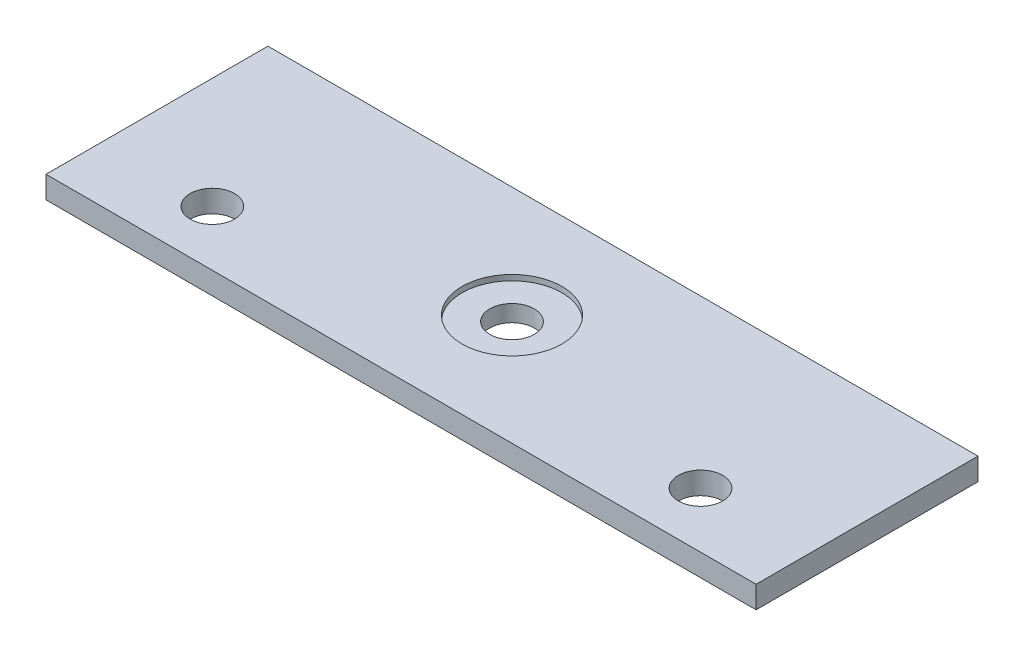
ISO-10303-21;
HEADER;
FILE_DESCRIPTION(('STEP AP214'),'2;1');
FILE_NAME('part.step','',(''),(''),'','','');
FILE_SCHEMA(('AUTOMOTIVE_DESIGN { 1 0 10303 214 1 1 1 1 }'));
ENDSEC;
DATA;
#1=APPLICATION_CONTEXT('core data for automotive mechanical design processes');
#2=APPLICATION_PROTOCOL_DEFINITION('international standard','automotive_design',2000,#1);
#3=PRODUCT_CONTEXT('',#1,'mechanical');
#4=PRODUCT('Part','Part','',(#3));
#5=PRODUCT_RELATED_PRODUCT_CATEGORY('part','',(#4));
#6=PRODUCT_DEFINITION_FORMATION('','',#4);
#7=PRODUCT_DEFINITION_CONTEXT('part definition',#1,'design');
#8=PRODUCT_DEFINITION('design','',#6,#7);
#9=PRODUCT_DEFINITION_SHAPE('','',#8);
#10=(LENGTH_UNIT() NAMED_UNIT(*) SI_UNIT(.MILLI.,.METRE.));
#11=(NAMED_UNIT(*) PLANE_ANGLE_UNIT() SI_UNIT($,.RADIAN.));
#12=(NAMED_UNIT(*) SI_UNIT($,.STERADIAN.) SOLID_ANGLE_UNIT());
#13=UNCERTAINTY_MEASURE_WITH_UNIT(LENGTH_MEASURE(1.E-05),#10,'distance_accuracy_value','');
#14=(GEOMETRIC_REPRESENTATION_CONTEXT(3) GLOBAL_UNCERTAINTY_ASSIGNED_CONTEXT((#13)) GLOBAL_UNIT_ASSIGNED_CONTEXT((#10,
#11,#12)) REPRESENTATION_CONTEXT('',''));
#15=CARTESIAN_POINT('',(0.,0.,0.));
#16=DIRECTION('',(0.,0.,1.));
#17=DIRECTION('',(1.,0.,0.));
#18=AXIS2_PLACEMENT_3D('',#15,#16,#17);
#19=CARTESIAN_POINT('',(0.,6.35,0.));
#20=DIRECTION('',(-1.,0.,0.));
#21=DIRECTION('',(0.,0.,1.));
#22=AXIS2_PLACEMENT_3D('',#19,#20,#21);
#23=PLANE('',#22);
#24=DIRECTION('',(0.,0.,-1.));
#25=VECTOR('',#24,1.);
#26=CARTESIAN_POINT('',(0.,0.,0.));
#27=LINE('',#26,#25);
#28=CARTESIAN_POINT('',(0.,0.,0.));
#29=VERTEX_POINT('',#28);
#30=CARTESIAN_POINT('',(0.,0.,-63.5));
#31=VERTEX_POINT('',#30);
#32=EDGE_CURVE('E95',#29,#31,#27,.T.);
#33=ORIENTED_EDGE('',*,*,#32,.T.);
#34=DIRECTION('',(0.,-1.,0.));
#35=VECTOR('',#34,1.);
#36=CARTESIAN_POINT('',(0.,6.35,-63.5));
#37=LINE('',#36,#35);
#38=CARTESIAN_POINT('',(0.,6.35,-63.5));
#39=VERTEX_POINT('',#38);
#40=EDGE_CURVE('E11',#39,#31,#37,.T.);
#41=ORIENTED_EDGE('',*,*,#40,.F.);
#42=DIRECTION('',(0.,0.,-1.));
#43=VECTOR('',#42,1.);
#44=CARTESIAN_POINT('',(0.,6.35,0.));
#45=LINE('',#44,#43);
#46=CARTESIAN_POINT('',(0.,6.35,0.));
#47=VERTEX_POINT('',#46);
#48=EDGE_CURVE('E83',#47,#39,#45,.T.);
#49=ORIENTED_EDGE('',*,*,#48,.F.);
#50=DIRECTION('',(0.,-1.,0.));
#51=VECTOR('',#50,1.);
#52=CARTESIAN_POINT('',(0.,6.35,0.));
#53=LINE('',#52,#51);
#54=EDGE_CURVE('E91',#47,#29,#53,.T.);
#55=ORIENTED_EDGE('',*,*,#54,.T.);
#56=EDGE_LOOP('',(#33,#41,#49,#55));
#57=FACE_BOUND('',#56,.T.);
#58=ADVANCED_FACE('F32',(#57),#23,.F.);
#59=CARTESIAN_POINT('',(0.,6.35,-63.5));
#60=DIRECTION('',(0.,0.,1.));
#61=DIRECTION('',(1.,0.,0.));
#62=AXIS2_PLACEMENT_3D('',#59,#60,#61);
#63=PLANE('',#62);
#64=DIRECTION('',(-1.,0.,0.));
#65=VECTOR('',#64,1.);
#66=CARTESIAN_POINT('',(0.,0.,-63.5));
#67=LINE('',#66,#65);
#68=CARTESIAN_POINT('',(-203.2,0.,-63.5));
#69=VERTEX_POINT('',#68);
#70=EDGE_CURVE('E87',#31,#69,#67,.T.);
#71=ORIENTED_EDGE('',*,*,#70,.T.);
#72=DIRECTION('',(0.,-1.,0.));
#73=VECTOR('',#72,1.);
#74=CARTESIAN_POINT('',(-203.2,6.35,-63.5));
#75=LINE('',#74,#73);
#76=CARTESIAN_POINT('',(-203.2,6.35,-63.5));
#77=VERTEX_POINT('',#76);
#78=EDGE_CURVE('E40',#77,#69,#75,.T.);
#79=ORIENTED_EDGE('',*,*,#78,.F.);
#80=DIRECTION('',(-1.,0.,0.));
#81=VECTOR('',#80,1.);
#82=CARTESIAN_POINT('',(0.,6.35,-63.5));
#83=LINE('',#82,#81);
#84=EDGE_CURVE('E78',#39,#77,#83,.T.);
#85=ORIENTED_EDGE('',*,*,#84,.F.);
#86=ORIENTED_EDGE('',*,*,#40,.T.);
#87=EDGE_LOOP('',(#71,#79,#85,#86));
#88=FACE_BOUND('',#87,.T.);
#89=ADVANCED_FACE('F86',(#88),#63,.F.);
#90=CARTESIAN_POINT('',(-203.2,6.35,0.));
#91=DIRECTION('',(1.,0.,0.));
#92=DIRECTION('',(0.,0.,-1.));
#93=AXIS2_PLACEMENT_3D('',#90,#91,#92);
#94=PLANE('',#93);
#95=DIRECTION('',(0.,0.,1.));
#96=VECTOR('',#95,1.);
#97=CARTESIAN_POINT('',(-203.2,0.,0.));
#98=LINE('',#97,#96);
#99=CARTESIAN_POINT('',(-203.2,0.,0.));
#100=VERTEX_POINT('',#99);
#101=EDGE_CURVE('E65',#69,#100,#98,.T.);
#102=ORIENTED_EDGE('',*,*,#101,.T.);
#103=DIRECTION('',(0.,-1.,0.));
#104=VECTOR('',#103,1.);
#105=CARTESIAN_POINT('',(-203.2,6.35,0.));
#106=LINE('',#105,#104);
#107=CARTESIAN_POINT('',(-203.2,6.35,0.));
#108=VERTEX_POINT('',#107);
#109=EDGE_CURVE('E88',#108,#100,#106,.T.);
#110=ORIENTED_EDGE('',*,*,#109,.F.);
#111=DIRECTION('',(0.,0.,1.));
#112=VECTOR('',#111,1.);
#113=CARTESIAN_POINT('',(-203.2,6.35,0.));
#114=LINE('',#113,#112);
#115=EDGE_CURVE('E81',#77,#108,#114,.T.);
#116=ORIENTED_EDGE('',*,*,#115,.F.);
#117=ORIENTED_EDGE('',*,*,#78,.T.);
#118=EDGE_LOOP('',(#102,#110,#116,#117));
#119=FACE_BOUND('',#118,.T.);
#120=ADVANCED_FACE('F89',(#119),#94,.F.);
#121=CARTESIAN_POINT('',(0.,6.35,0.));
#122=DIRECTION('',(0.,0.,-1.));
#123=DIRECTION('',(-1.,0.,0.));
#124=AXIS2_PLACEMENT_3D('',#121,#122,#123);
#125=PLANE('',#124);
#126=DIRECTION('',(1.,0.,0.));
#127=VECTOR('',#126,1.);
#128=CARTESIAN_POINT('',(0.,0.,0.));
#129=LINE('',#128,#127);
#130=EDGE_CURVE('E71',#100,#29,#129,.T.);
#131=ORIENTED_EDGE('',*,*,#130,.T.);
#132=ORIENTED_EDGE('',*,*,#54,.F.);
#133=DIRECTION('',(1.,0.,0.));
#134=VECTOR('',#133,1.);
#135=CARTESIAN_POINT('',(0.,6.35,0.));
#136=LINE('',#135,#134);
#137=EDGE_CURVE('E48',#108,#47,#136,.T.);
#138=ORIENTED_EDGE('',*,*,#137,.F.);
#139=ORIENTED_EDGE('',*,*,#109,.T.);
#140=EDGE_LOOP('',(#131,#132,#138,#139));
#141=FACE_BOUND('',#140,.T.);
#142=ADVANCED_FACE('F103',(#141),#125,.F.);
#143=CARTESIAN_POINT('',(0.,6.35,0.));
#144=DIRECTION('',(0.,1.,0.));
#145=DIRECTION('',(0.,0.,1.));
#146=AXIS2_PLACEMENT_3D('',#143,#144,#145);
#147=PLANE('',#146);
#148=CARTESIAN_POINT('',(-171.45,6.35,-15.85));
#149=DIRECTION('',(0.,1.,0.));
#150=DIRECTION('',(0.,0.,1.));
#151=AXIS2_PLACEMENT_3D('',#148,#149,#150);
#152=CIRCLE('',#151,6.35);
#153=CARTESIAN_POINT('',(-171.45,6.35,-9.50000000000001));
#154=VERTEX_POINT('',#153);
#155=EDGE_CURVE('E127',#154,#154,#152,.T.);
#156=ORIENTED_EDGE('',*,*,#155,.F.);
#157=EDGE_LOOP('',(#156));
#158=FACE_BOUND('',#157,.T.);
#159=CARTESIAN_POINT('',(-31.75,6.35,-15.85));
#160=DIRECTION('',(0.,1.,0.));
#161=DIRECTION('',(0.,0.,1.));
#162=AXIS2_PLACEMENT_3D('',#159,#160,#161);
#163=CIRCLE('',#162,6.35);
#164=CARTESIAN_POINT('',(-31.75,6.35,-9.5));
#165=VERTEX_POINT('',#164);
#166=EDGE_CURVE('E121',#165,#165,#163,.T.);
#167=ORIENTED_EDGE('',*,*,#166,.F.);
#168=EDGE_LOOP('',(#167));
#169=FACE_BOUND('',#168,.T.);
#170=CARTESIAN_POINT('',(-101.6,6.35,-31.75));
#171=DIRECTION('',(0.,1.,0.));
#172=DIRECTION('',(0.,0.,1.));
#173=AXIS2_PLACEMENT_3D('',#170,#171,#172);
#174=CIRCLE('',#173,14.2875);
#175=CARTESIAN_POINT('',(-101.6,6.35,-17.4625));
#176=VERTEX_POINT('',#175);
#177=EDGE_CURVE('E109',#176,#176,#174,.T.);
#178=ORIENTED_EDGE('',*,*,#177,.F.);
#179=EDGE_LOOP('',(#178));
#180=FACE_BOUND('',#179,.T.);
#181=ORIENTED_EDGE('',*,*,#48,.T.);
#182=ORIENTED_EDGE('',*,*,#84,.T.);
#183=ORIENTED_EDGE('',*,*,#115,.T.);
#184=ORIENTED_EDGE('',*,*,#137,.T.);
#185=EDGE_LOOP('',(#181,#182,#183,#184));
#186=FACE_BOUND('',#185,.T.);
#187=ADVANCED_FACE('F79',(#158,#169,#180,#186),#147,.T.);
#188=CARTESIAN_POINT('',(0.,0.,0.));
#189=DIRECTION('',(0.,1.,0.));
#190=DIRECTION('',(0.,0.,1.));
#191=AXIS2_PLACEMENT_3D('',#188,#189,#190);
#192=PLANE('',#191);
#193=CARTESIAN_POINT('',(-171.45,0.,-15.85));
#194=DIRECTION('',(0.,1.,0.));
#195=DIRECTION('',(0.,0.,1.));
#196=AXIS2_PLACEMENT_3D('',#193,#194,#195);
#197=CIRCLE('',#196,6.35);
#198=CARTESIAN_POINT('',(-171.45,0.,-9.50000000000001));
#199=VERTEX_POINT('',#198);
#200=EDGE_CURVE('E118',#199,#199,#197,.T.);
#201=ORIENTED_EDGE('',*,*,#200,.T.);
#202=EDGE_LOOP('',(#201));
#203=FACE_BOUND('',#202,.T.);
#204=CARTESIAN_POINT('',(-31.75,0.,-15.85));
#205=DIRECTION('',(0.,1.,0.));
#206=DIRECTION('',(0.,0.,1.));
#207=AXIS2_PLACEMENT_3D('',#204,#205,#206);
#208=CIRCLE('',#207,6.35);
#209=CARTESIAN_POINT('',(-31.75,0.,-9.5));
#210=VERTEX_POINT('',#209);
#211=EDGE_CURVE('E124',#210,#210,#208,.T.);
#212=ORIENTED_EDGE('',*,*,#211,.T.);
#213=EDGE_LOOP('',(#212));
#214=FACE_BOUND('',#213,.T.);
#215=CARTESIAN_POINT('',(-101.6,0.,-31.75));
#216=DIRECTION('',(0.,1.,0.));
#217=DIRECTION('',(0.,0.,1.));
#218=AXIS2_PLACEMENT_3D('',#215,#216,#217);
#219=CIRCLE('',#218,6.35000000000001);
#220=CARTESIAN_POINT('',(-101.6,0.,-25.4));
#221=VERTEX_POINT('',#220);
#222=EDGE_CURVE('E112',#221,#221,#219,.T.);
#223=ORIENTED_EDGE('',*,*,#222,.T.);
#224=EDGE_LOOP('',(#223));
#225=FACE_BOUND('',#224,.T.);
#226=ORIENTED_EDGE('',*,*,#32,.F.);
#227=ORIENTED_EDGE('',*,*,#130,.F.);
#228=ORIENTED_EDGE('',*,*,#101,.F.);
#229=ORIENTED_EDGE('',*,*,#70,.F.);
#230=EDGE_LOOP('',(#226,#227,#228,#229));
#231=FACE_BOUND('',#230,.T.);
#232=ADVANCED_FACE('F106',(#203,#214,#225,#231),#192,.F.);
#233=CARTESIAN_POINT('',(-101.6,4.7625,-31.75));
#234=DIRECTION('',(0.,1.,0.));
#235=DIRECTION('',(0.,0.,1.));
#236=AXIS2_PLACEMENT_3D('',#233,#234,#235);
#237=CYLINDRICAL_SURFACE('',#236,14.2875);
#238=CARTESIAN_POINT('',(-101.6,4.7625,-31.75));
#239=DIRECTION('',(0.,1.,0.));
#240=DIRECTION('',(0.,0.,1.));
#241=AXIS2_PLACEMENT_3D('',#238,#239,#240);
#242=CIRCLE('',#241,14.2875);
#243=CARTESIAN_POINT('',(-101.6,4.7625,-17.4625));
#244=VERTEX_POINT('',#243);
#245=EDGE_CURVE('E98',#244,#244,#242,.T.);
#246=ORIENTED_EDGE('',*,*,#245,.F.);
#247=EDGE_LOOP('',(#246));
#248=FACE_BOUND('',#247,.T.);
#249=ORIENTED_EDGE('',*,*,#177,.T.);
#250=EDGE_LOOP('',(#249));
#251=FACE_BOUND('',#250,.T.);
#252=ADVANCED_FACE('F149',(#248,#251),#237,.F.);
#253=CARTESIAN_POINT('',(-101.6,4.7625,-31.75));
#254=DIRECTION('',(0.,1.,0.));
#255=DIRECTION('',(0.,0.,1.));
#256=AXIS2_PLACEMENT_3D('',#253,#254,#255);
#257=PLANE('',#256);
#258=CARTESIAN_POINT('',(-101.6,4.7625,-31.75));
#259=DIRECTION('',(0.,1.,0.));
#260=DIRECTION('',(0.,0.,1.));
#261=AXIS2_PLACEMENT_3D('',#258,#259,#260);
#262=CIRCLE('',#261,6.35000000000001);
#263=CARTESIAN_POINT('',(-101.6,4.7625,-25.4));
#264=VERTEX_POINT('',#263);
#265=EDGE_CURVE('E115',#264,#264,#262,.T.);
#266=ORIENTED_EDGE('',*,*,#265,.F.);
#267=EDGE_LOOP('',(#266));
#268=FACE_BOUND('',#267,.T.);
#269=ORIENTED_EDGE('',*,*,#245,.T.);
#270=EDGE_LOOP('',(#269));
#271=FACE_BOUND('',#270,.T.);
#272=ADVANCED_FACE('F151',(#268,#271),#257,.T.);
#273=CARTESIAN_POINT('',(-101.6,0.,-31.75));
#274=DIRECTION('',(0.,1.,0.));
#275=DIRECTION('',(0.,0.,1.));
#276=AXIS2_PLACEMENT_3D('',#273,#274,#275);
#277=CYLINDRICAL_SURFACE('',#276,6.35000000000001);
#278=ORIENTED_EDGE('',*,*,#222,.F.);
#279=EDGE_LOOP('',(#278));
#280=FACE_BOUND('',#279,.T.);
#281=ORIENTED_EDGE('',*,*,#265,.T.);
#282=EDGE_LOOP('',(#281));
#283=FACE_BOUND('',#282,.T.);
#284=ADVANCED_FACE('F158',(#280,#283),#277,.F.);
#285=CARTESIAN_POINT('',(-31.75,0.,-15.85));
#286=DIRECTION('',(0.,1.,0.));
#287=DIRECTION('',(0.,0.,1.));
#288=AXIS2_PLACEMENT_3D('',#285,#286,#287);
#289=CYLINDRICAL_SURFACE('',#288,6.35);
#290=ORIENTED_EDGE('',*,*,#211,.F.);
#291=EDGE_LOOP('',(#290));
#292=FACE_BOUND('',#291,.T.);
#293=ORIENTED_EDGE('',*,*,#166,.T.);
#294=EDGE_LOOP('',(#293));
#295=FACE_BOUND('',#294,.T.);
#296=ADVANCED_FACE('F138',(#292,#295),#289,.F.);
#297=CARTESIAN_POINT('',(-171.45,0.,-15.85));
#298=DIRECTION('',(0.,1.,0.));
#299=DIRECTION('',(0.,0.,1.));
#300=AXIS2_PLACEMENT_3D('',#297,#298,#299);
#301=CYLINDRICAL_SURFACE('',#300,6.35);
#302=ORIENTED_EDGE('',*,*,#200,.F.);
#303=EDGE_LOOP('',(#302));
#304=FACE_BOUND('',#303,.T.);
#305=ORIENTED_EDGE('',*,*,#155,.T.);
#306=EDGE_LOOP('',(#305));
#307=FACE_BOUND('',#306,.T.);
#308=ADVANCED_FACE('F135',(#304,#307),#301,.F.);
#309=CLOSED_SHELL('',(#58,#89,#120,#142,#187,#232,#252,#272,#284,#296,#308));
#310=MANIFOLD_SOLID_BREP('B2',#309);
#311=ADVANCED_BREP_SHAPE_REPRESENTATION('',(#18,#310),#14);
#312=SHAPE_DEFINITION_REPRESENTATION(#9,#311);
ENDSEC;
END-ISO-10303-21;
